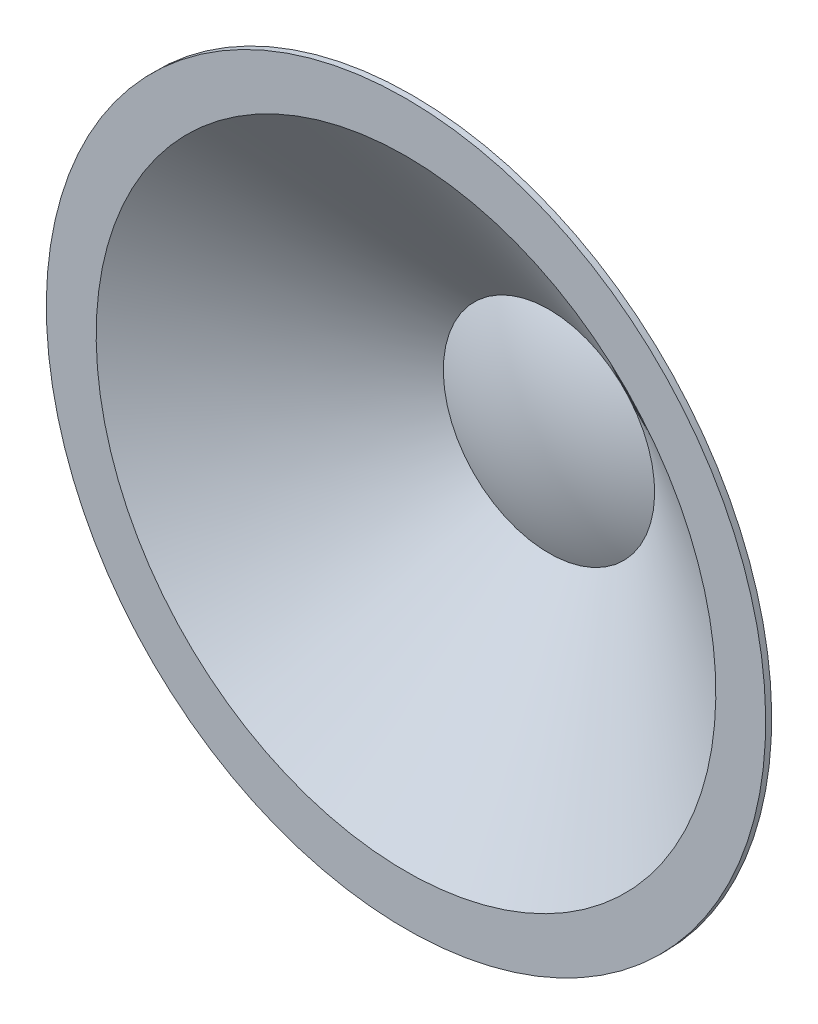
ISO-10303-21;
HEADER;
FILE_DESCRIPTION(('STEP AP214'),'2;1');
FILE_NAME('part.step','',(''),(''),'','','');
FILE_SCHEMA(('AUTOMOTIVE_DESIGN { 1 0 10303 214 1 1 1 1 }'));
ENDSEC;
DATA;
#1=APPLICATION_CONTEXT('core data for automotive mechanical design processes');
#2=APPLICATION_PROTOCOL_DEFINITION('international standard','automotive_design',2000,#1);
#3=PRODUCT_CONTEXT('',#1,'mechanical');
#4=PRODUCT('Part','Part','',(#3));
#5=PRODUCT_RELATED_PRODUCT_CATEGORY('part','',(#4));
#6=PRODUCT_DEFINITION_FORMATION('','',#4);
#7=PRODUCT_DEFINITION_CONTEXT('part definition',#1,'design');
#8=PRODUCT_DEFINITION('design','',#6,#7);
#9=PRODUCT_DEFINITION_SHAPE('','',#8);
#10=(LENGTH_UNIT() NAMED_UNIT(*) SI_UNIT(.MILLI.,.METRE.));
#11=(NAMED_UNIT(*) PLANE_ANGLE_UNIT() SI_UNIT($,.RADIAN.));
#12=(NAMED_UNIT(*) SI_UNIT($,.STERADIAN.) SOLID_ANGLE_UNIT());
#13=UNCERTAINTY_MEASURE_WITH_UNIT(LENGTH_MEASURE(1.E-05),#10,'distance_accuracy_value','');
#14=(GEOMETRIC_REPRESENTATION_CONTEXT(3) GLOBAL_UNCERTAINTY_ASSIGNED_CONTEXT((#13)) GLOBAL_UNIT_ASSIGNED_CONTEXT((#10,
#11,#12)) REPRESENTATION_CONTEXT('',''));
#15=CARTESIAN_POINT('',(0.,0.,0.));
#16=DIRECTION('',(0.,0.,1.));
#17=DIRECTION('',(1.,0.,0.));
#18=AXIS2_PLACEMENT_3D('',#15,#16,#17);
#19=CARTESIAN_POINT('',(0.,0.,-30.6347531980435));
#20=DIRECTION('',(0.,0.,-1.));
#21=DIRECTION('',(0.,1.,0.));
#22=AXIS2_PLACEMENT_3D('',#19,#20,#21);
#23=SPHERICAL_SURFACE('',#22,21.1347531980435);
#24=CARTESIAN_POINT('',(0.,0.,-11.4247268203114));
#25=DIRECTION('',(0.,0.,-1.));
#26=DIRECTION('',(0.,1.,0.));
#27=AXIS2_PLACEMENT_3D('',#24,#25,#26);
#28=CIRCLE('',#27,8.81207576618856);
#29=CARTESIAN_POINT('',(0.,8.81207576618856,-11.4247268203114));
#30=VERTEX_POINT('',#29);
#31=EDGE_CURVE('E62',#30,#30,#28,.T.);
#32=ORIENTED_EDGE('',*,*,#31,.F.);
#33=EDGE_LOOP('',(#32));
#34=FACE_BOUND('',#33,.T.);
#35=ADVANCED_FACE('F40',(#34),#23,.T.);
#36=CARTESIAN_POINT('',(0.,0.,-30.6347531980435));
#37=DIRECTION('',(0.,0.,-1.));
#38=DIRECTION('',(0.,1.,0.));
#39=AXIS2_PLACEMENT_3D('',#36,#37,#38);
#40=SPHERICAL_SURFACE('',#39,20.6347531980435);
#41=CARTESIAN_POINT('',(0.,0.,-12.));
#42=DIRECTION('',(0.,0.,-1.));
#43=DIRECTION('',(0.,1.,0.));
#44=AXIS2_PLACEMENT_3D('',#41,#42,#43);
#45=CIRCLE('',#44,8.86222391909467);
#46=CARTESIAN_POINT('',(0.,8.86222391909467,-12.));
#47=VERTEX_POINT('',#46);
#48=EDGE_CURVE('E10',#47,#47,#45,.T.);
#49=ORIENTED_EDGE('',*,*,#48,.T.);
#50=EDGE_LOOP('',(#49));
#51=FACE_BOUND('',#50,.T.);
#52=ADVANCED_FACE('F70',(#51),#40,.F.);
#53=CARTESIAN_POINT('',(0.,0.,0.));
#54=DIRECTION('',(0.,0.,1.));
#55=DIRECTION('',(0.,-1.,0.));
#56=AXIS2_PLACEMENT_3D('',#53,#54,#55);
#57=CONICAL_SURFACE('',#56,26.,0.95993108859688);
#58=ORIENTED_EDGE('',*,*,#48,.F.);
#59=EDGE_LOOP('',(#58));
#60=FACE_BOUND('',#59,.T.);
#61=CARTESIAN_POINT('',(0.,0.,0.));
#62=DIRECTION('',(0.,0.,-1.));
#63=DIRECTION('',(0.,1.,0.));
#64=AXIS2_PLACEMENT_3D('',#61,#62,#63);
#65=CIRCLE('',#64,26.);
#66=CARTESIAN_POINT('',(0.,26.,0.));
#67=VERTEX_POINT('',#66);
#68=EDGE_CURVE('E46',#67,#67,#65,.T.);
#69=ORIENTED_EDGE('',*,*,#68,.T.);
#70=EDGE_LOOP('',(#69));
#71=FACE_BOUND('',#70,.T.);
#72=ADVANCED_FACE('F74',(#60,#71),#57,.T.);
#73=CARTESIAN_POINT('',(0.,30.,0.));
#74=DIRECTION('',(0.,0.,1.));
#75=DIRECTION('',(0.,-1.,0.));
#76=AXIS2_PLACEMENT_3D('',#73,#74,#75);
#77=PLANE('',#76);
#78=ORIENTED_EDGE('',*,*,#68,.F.);
#79=EDGE_LOOP('',(#78));
#80=FACE_BOUND('',#79,.T.);
#81=CARTESIAN_POINT('',(0.,0.,0.));
#82=DIRECTION('',(0.,0.,-1.));
#83=DIRECTION('',(0.,1.,0.));
#84=AXIS2_PLACEMENT_3D('',#81,#82,#83);
#85=CIRCLE('',#84,30.);
#86=CARTESIAN_POINT('',(0.,30.,0.));
#87=VERTEX_POINT('',#86);
#88=EDGE_CURVE('E50',#87,#87,#85,.T.);
#89=ORIENTED_EDGE('',*,*,#88,.T.);
#90=EDGE_LOOP('',(#89));
#91=FACE_BOUND('',#90,.T.);
#92=ADVANCED_FACE('F78',(#80,#91),#77,.F.);
#93=CARTESIAN_POINT('',(0.,0.,-12.));
#94=DIRECTION('',(0.,0.,-1.));
#95=DIRECTION('',(0.,1.,0.));
#96=AXIS2_PLACEMENT_3D('',#93,#94,#95);
#97=CYLINDRICAL_SURFACE('',#96,30.);
#98=ORIENTED_EDGE('',*,*,#88,.F.);
#99=EDGE_LOOP('',(#98));
#100=FACE_BOUND('',#99,.T.);
#101=CARTESIAN_POINT('',(0.,0.,0.5));
#102=DIRECTION('',(0.,0.,-1.));
#103=DIRECTION('',(0.,1.,0.));
#104=AXIS2_PLACEMENT_3D('',#101,#102,#103);
#105=CIRCLE('',#104,30.);
#106=CARTESIAN_POINT('',(0.,30.,0.500000000000001));
#107=VERTEX_POINT('',#106);
#108=EDGE_CURVE('E54',#107,#107,#105,.T.);
#109=ORIENTED_EDGE('',*,*,#108,.T.);
#110=EDGE_LOOP('',(#109));
#111=FACE_BOUND('',#110,.T.);
#112=ADVANCED_FACE('F84',(#100,#111),#97,.T.);
#113=CARTESIAN_POINT('',(0.,30.,0.5));
#114=DIRECTION('',(0.,0.,1.));
#115=DIRECTION('',(0.,-1.,0.));
#116=AXIS2_PLACEMENT_3D('',#113,#114,#115);
#117=PLANE('',#116);
#118=CARTESIAN_POINT('',(0.,0.,0.499999999999999));
#119=DIRECTION('',(0.,0.,-1.));
#120=DIRECTION('',(0.,1.,0.));
#121=AXIS2_PLACEMENT_3D('',#118,#119,#120);
#122=CIRCLE('',#121,25.8423506055605);
#123=CARTESIAN_POINT('',(0.,25.8423506055605,0.499999999999999));
#124=VERTEX_POINT('',#123);
#125=EDGE_CURVE('E59',#124,#124,#122,.T.);
#126=ORIENTED_EDGE('',*,*,#125,.T.);
#127=EDGE_LOOP('',(#126));
#128=FACE_BOUND('',#127,.T.);
#129=ORIENTED_EDGE('',*,*,#108,.F.);
#130=EDGE_LOOP('',(#129));
#131=FACE_BOUND('',#130,.T.);
#132=ADVANCED_FACE('F88',(#128,#131),#117,.T.);
#133=CARTESIAN_POINT('',(0.,0.,0.499999999999999));
#134=DIRECTION('',(0.,0.,1.));
#135=DIRECTION('',(0.,-1.,0.));
#136=AXIS2_PLACEMENT_3D('',#133,#134,#135);
#137=CONICAL_SURFACE('',#136,25.8423506055605,0.95993108859688);
#138=ORIENTED_EDGE('',*,*,#31,.T.);
#139=EDGE_LOOP('',(#138));
#140=FACE_BOUND('',#139,.T.);
#141=ORIENTED_EDGE('',*,*,#125,.F.);
#142=EDGE_LOOP('',(#141));
#143=FACE_BOUND('',#142,.T.);
#144=ADVANCED_FACE('F66',(#140,#143),#137,.F.);
#145=CLOSED_SHELL('',(#35,#52,#72,#92,#112,#132,#144));
#146=MANIFOLD_SOLID_BREP('B2',#145);
#147=ADVANCED_BREP_SHAPE_REPRESENTATION('',(#18,#146),#14);
#148=SHAPE_DEFINITION_REPRESENTATION(#9,#147);
ENDSEC;
END-ISO-10303-21;
